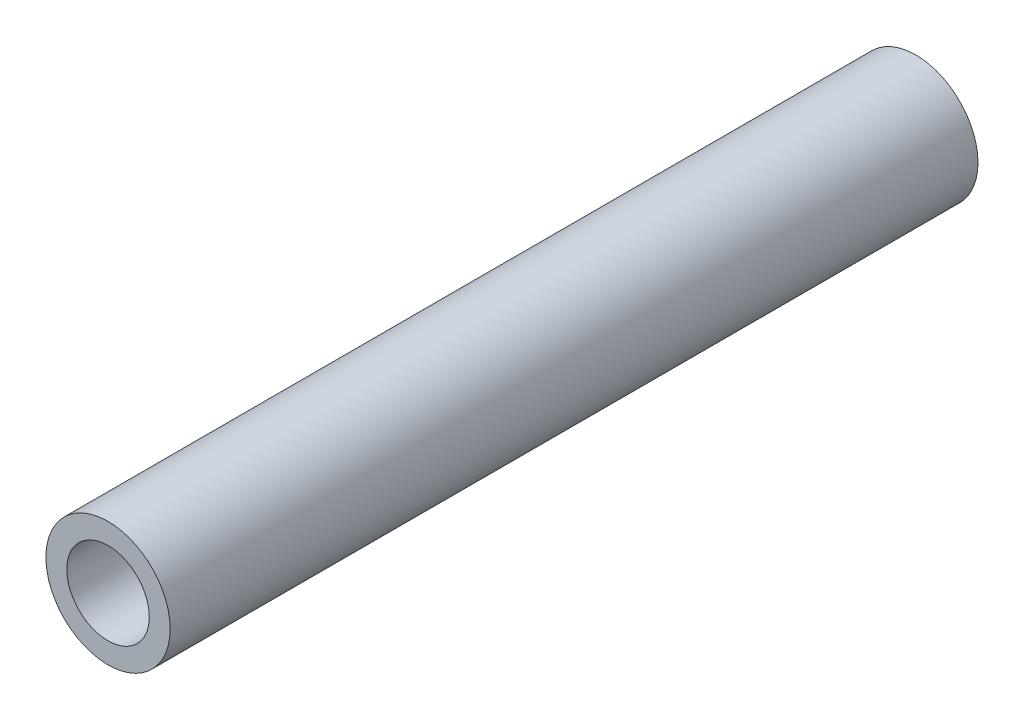
ISO-10303-21;
HEADER;
FILE_DESCRIPTION(('STEP AP214'),'2;1');
FILE_NAME('part.step','',(''),(''),'','','');
FILE_SCHEMA(('AUTOMOTIVE_DESIGN { 1 0 10303 214 1 1 1 1 }'));
ENDSEC;
DATA;
#1=APPLICATION_CONTEXT('core data for automotive mechanical design processes');
#2=APPLICATION_PROTOCOL_DEFINITION('international standard','automotive_design',2000,#1);
#3=PRODUCT_CONTEXT('',#1,'mechanical');
#4=PRODUCT('Part','Part','',(#3));
#5=PRODUCT_RELATED_PRODUCT_CATEGORY('part','',(#4));
#6=PRODUCT_DEFINITION_FORMATION('','',#4);
#7=PRODUCT_DEFINITION_CONTEXT('part definition',#1,'design');
#8=PRODUCT_DEFINITION('design','',#6,#7);
#9=PRODUCT_DEFINITION_SHAPE('','',#8);
#10=(LENGTH_UNIT() NAMED_UNIT(*) SI_UNIT(.MILLI.,.METRE.));
#11=(NAMED_UNIT(*) PLANE_ANGLE_UNIT() SI_UNIT($,.RADIAN.));
#12=(NAMED_UNIT(*) SI_UNIT($,.STERADIAN.) SOLID_ANGLE_UNIT());
#13=UNCERTAINTY_MEASURE_WITH_UNIT(LENGTH_MEASURE(1.E-05),#10,'distance_accuracy_value','');
#14=(GEOMETRIC_REPRESENTATION_CONTEXT(3) GLOBAL_UNCERTAINTY_ASSIGNED_CONTEXT((#13)) GLOBAL_UNIT_ASSIGNED_CONTEXT((#10,
#11,#12)) REPRESENTATION_CONTEXT('',''));
#15=CARTESIAN_POINT('',(0.,0.,0.));
#16=DIRECTION('',(0.,0.,1.));
#17=DIRECTION('',(1.,0.,0.));
#18=AXIS2_PLACEMENT_3D('',#15,#16,#17);
#19=CARTESIAN_POINT('',(4.54299470218782E-13,-2.03580925539054E-12,-41.275));
#20=DIRECTION('',(0.,0.,1.));
#21=DIRECTION('',(1.,0.,0.));
#22=AXIS2_PLACEMENT_3D('',#19,#20,#21);
#23=CYLINDRICAL_SURFACE('',#22,3.17499999999998);
#24=CARTESIAN_POINT('',(4.54299470218782E-13,-2.03580925539054E-12,-41.275));
#25=DIRECTION('',(0.,0.,1.));
#26=DIRECTION('',(1.,0.,0.));
#27=AXIS2_PLACEMENT_3D('',#24,#25,#26);
#28=CIRCLE('',#27,3.17499999999998);
#29=CARTESIAN_POINT('',(3.17500000000044,-2.03580925539054E-12,-41.275));
#30=VERTEX_POINT('',#29);
#31=EDGE_CURVE('E41',#30,#30,#28,.T.);
#32=ORIENTED_EDGE('',*,*,#31,.T.);
#33=EDGE_LOOP('',(#32));
#34=FACE_BOUND('',#33,.T.);
#35=CARTESIAN_POINT('',(4.54299470218782E-13,-2.03580925539054E-12,0.));
#36=DIRECTION('',(0.,0.,1.));
#37=DIRECTION('',(1.,0.,0.));
#38=AXIS2_PLACEMENT_3D('',#35,#36,#37);
#39=CIRCLE('',#38,3.17499999999998);
#40=CARTESIAN_POINT('',(3.17500000000044,-2.03580925539054E-12,0.));
#41=VERTEX_POINT('',#40);
#42=EDGE_CURVE('E45',#41,#41,#39,.T.);
#43=ORIENTED_EDGE('',*,*,#42,.F.);
#44=EDGE_LOOP('',(#43));
#45=FACE_BOUND('',#44,.T.);
#46=ADVANCED_FACE('F30',(#34,#45),#23,.T.);
#47=CARTESIAN_POINT('',(4.54299470218782E-13,-2.03580925539054E-12,-41.275));
#48=DIRECTION('',(0.,0.,1.));
#49=DIRECTION('',(1.,0.,0.));
#50=AXIS2_PLACEMENT_3D('',#47,#48,#49);
#51=PLANE('',#50);
#52=CARTESIAN_POINT('',(4.54299470218782E-13,-2.03580925539054E-12,-41.275));
#53=DIRECTION('',(0.,0.,1.));
#54=DIRECTION('',(1.,0.,0.));
#55=AXIS2_PLACEMENT_3D('',#52,#53,#54);
#56=CIRCLE('',#55,2.36219999999997);
#57=CARTESIAN_POINT('',(2.36220000000043,-2.03580925539054E-12,-41.275));
#58=VERTEX_POINT('',#57);
#59=EDGE_CURVE('E37',#58,#58,#56,.T.);
#60=ORIENTED_EDGE('',*,*,#59,.T.);
#61=EDGE_LOOP('',(#60));
#62=FACE_BOUND('',#61,.T.);
#63=ORIENTED_EDGE('',*,*,#31,.F.);
#64=EDGE_LOOP('',(#63));
#65=FACE_BOUND('',#64,.T.);
#66=ADVANCED_FACE('F59',(#62,#65),#51,.F.);
#67=CARTESIAN_POINT('',(4.54299470218782E-13,-2.03580925539054E-12,0.));
#68=DIRECTION('',(0.,0.,1.));
#69=DIRECTION('',(1.,0.,0.));
#70=AXIS2_PLACEMENT_3D('',#67,#68,#69);
#71=PLANE('',#70);
#72=CARTESIAN_POINT('',(4.54299470218782E-13,-2.03580925539054E-12,0.));
#73=DIRECTION('',(0.,0.,1.));
#74=DIRECTION('',(1.,0.,0.));
#75=AXIS2_PLACEMENT_3D('',#72,#73,#74);
#76=CIRCLE('',#75,2.10819999999998);
#77=CARTESIAN_POINT('',(2.10820000000043,-2.03580925539054E-12,0.));
#78=VERTEX_POINT('',#77);
#79=EDGE_CURVE('E49',#78,#78,#76,.T.);
#80=ORIENTED_EDGE('',*,*,#79,.F.);
#81=EDGE_LOOP('',(#80));
#82=FACE_BOUND('',#81,.T.);
#83=ORIENTED_EDGE('',*,*,#42,.T.);
#84=EDGE_LOOP('',(#83));
#85=FACE_BOUND('',#84,.T.);
#86=ADVANCED_FACE('F56',(#82,#85),#71,.T.);
#87=CARTESIAN_POINT('',(4.54299470218782E-13,-2.03580925539054E-12,-41.275));
#88=DIRECTION('',(0.,0.,1.));
#89=DIRECTION('',(1.,0.,0.));
#90=AXIS2_PLACEMENT_3D('',#87,#88,#89);
#91=CYLINDRICAL_SURFACE('',#90,2.10819999999998);
#92=CARTESIAN_POINT('',(4.54299470218782E-13,-2.03580925539054E-12,-41.021));
#93=DIRECTION('',(0.,0.,1.));
#94=DIRECTION('',(1.,0.,0.));
#95=AXIS2_PLACEMENT_3D('',#92,#93,#94);
#96=CIRCLE('',#95,2.10819999999998);
#97=CARTESIAN_POINT('',(2.10820000000043,-2.03580925539054E-12,-41.021));
#98=VERTEX_POINT('',#97);
#99=EDGE_CURVE('E10',#98,#98,#96,.F.);
#100=ORIENTED_EDGE('',*,*,#99,.T.);
#101=EDGE_LOOP('',(#100));
#102=FACE_BOUND('',#101,.T.);
#103=ORIENTED_EDGE('',*,*,#79,.T.);
#104=EDGE_LOOP('',(#103));
#105=FACE_BOUND('',#104,.T.);
#106=ADVANCED_FACE('F54',(#102,#105),#91,.F.);
#107=CARTESIAN_POINT('',(4.54299470218782E-13,-2.03580925539054E-12,-41.275));
#108=DIRECTION('',(0.,0.,-1.));
#109=DIRECTION('',(-1.,0.,0.));
#110=AXIS2_PLACEMENT_3D('',#107,#108,#109);
#111=CONICAL_SURFACE('',#110,2.36219999999997,0.785398163397462);
#112=ORIENTED_EDGE('',*,*,#99,.F.);
#113=EDGE_LOOP('',(#112));
#114=FACE_BOUND('',#113,.T.);
#115=ORIENTED_EDGE('',*,*,#59,.F.);
#116=EDGE_LOOP('',(#115));
#117=FACE_BOUND('',#116,.T.);
#118=ADVANCED_FACE('F32',(#114,#117),#111,.F.);
#119=CLOSED_SHELL('',(#46,#66,#86,#106,#118));
#120=MANIFOLD_SOLID_BREP('B2',#119);
#121=ADVANCED_BREP_SHAPE_REPRESENTATION('',(#18,#120),#14);
#122=SHAPE_DEFINITION_REPRESENTATION(#9,#121);
ENDSEC;
END-ISO-10303-21;
